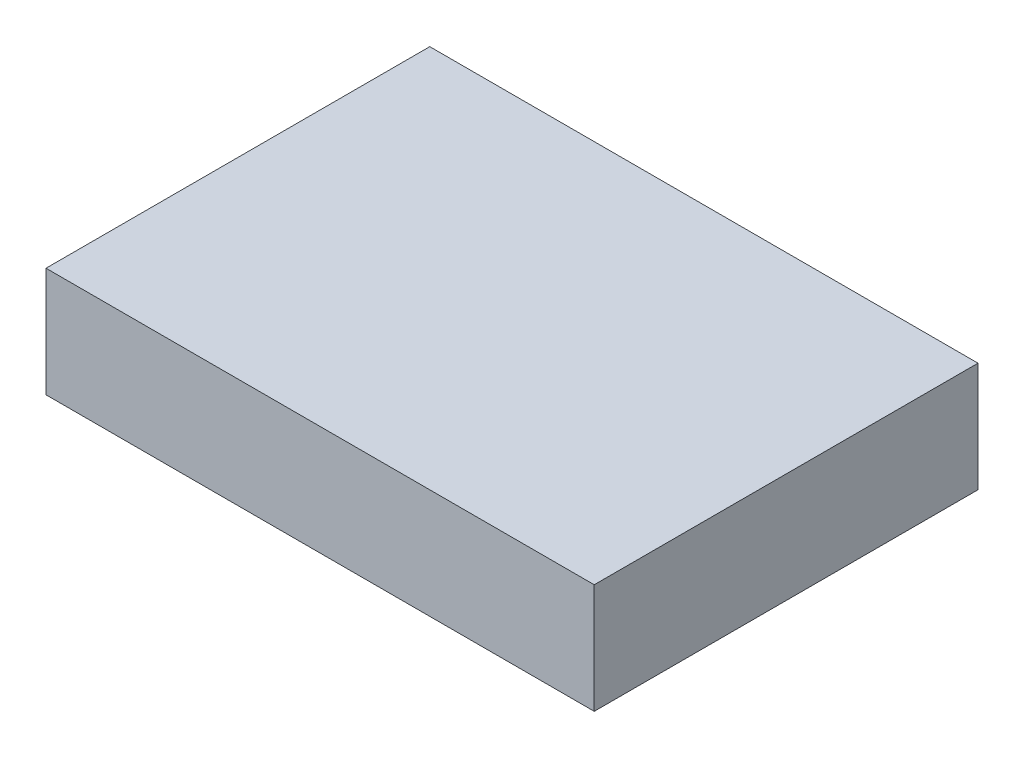
ISO-10303-21;
HEADER;
FILE_DESCRIPTION(('STEP AP214'),'2;1');
FILE_NAME('part.step','',(''),(''),'','','');
FILE_SCHEMA(('AUTOMOTIVE_DESIGN { 1 0 10303 214 1 1 1 1 }'));
ENDSEC;
DATA;
#1=APPLICATION_CONTEXT('core data for automotive mechanical design processes');
#2=APPLICATION_PROTOCOL_DEFINITION('international standard','automotive_design',2000,#1);
#3=PRODUCT_CONTEXT('',#1,'mechanical');
#4=PRODUCT('Part','Part','',(#3));
#5=PRODUCT_RELATED_PRODUCT_CATEGORY('part','',(#4));
#6=PRODUCT_DEFINITION_FORMATION('','',#4);
#7=PRODUCT_DEFINITION_CONTEXT('part definition',#1,'design');
#8=PRODUCT_DEFINITION('design','',#6,#7);
#9=PRODUCT_DEFINITION_SHAPE('','',#8);
#10=(LENGTH_UNIT() NAMED_UNIT(*) SI_UNIT(.MILLI.,.METRE.));
#11=(NAMED_UNIT(*) PLANE_ANGLE_UNIT() SI_UNIT($,.RADIAN.));
#12=(NAMED_UNIT(*) SI_UNIT($,.STERADIAN.) SOLID_ANGLE_UNIT());
#13=UNCERTAINTY_MEASURE_WITH_UNIT(LENGTH_MEASURE(1.E-05),#10,'distance_accuracy_value','');
#14=(GEOMETRIC_REPRESENTATION_CONTEXT(3) GLOBAL_UNCERTAINTY_ASSIGNED_CONTEXT((#13)) GLOBAL_UNIT_ASSIGNED_CONTEXT((#10,
#11,#12)) REPRESENTATION_CONTEXT('',''));
#15=CARTESIAN_POINT('',(0.,0.,0.));
#16=DIRECTION('',(0.,0.,1.));
#17=DIRECTION('',(1.,0.,0.));
#18=AXIS2_PLACEMENT_3D('',#15,#16,#17);
#19=CARTESIAN_POINT('',(-30.7894736842105,10.,-9.29824561403509));
#20=DIRECTION('',(1.,0.,0.));
#21=DIRECTION('',(0.,0.,-1.));
#22=AXIS2_PLACEMENT_3D('',#19,#20,#21);
#23=PLANE('',#22);
#24=DIRECTION('',(0.,0.,1.));
#25=VECTOR('',#24,1.);
#26=CARTESIAN_POINT('',(-30.7894736842105,0.,-9.29824561403509));
#27=LINE('',#26,#25);
#28=CARTESIAN_POINT('',(-30.7894736842105,0.,-9.29824561403509));
#29=VERTEX_POINT('',#28);
#30=CARTESIAN_POINT('',(-30.7894736842105,0.,25.7017543859649));
#31=VERTEX_POINT('',#30);
#32=EDGE_CURVE('E96',#29,#31,#27,.T.);
#33=ORIENTED_EDGE('',*,*,#32,.T.);
#34=DIRECTION('',(0.,-1.,0.));
#35=VECTOR('',#34,1.);
#36=CARTESIAN_POINT('',(-30.7894736842105,10.,25.7017543859649));
#37=LINE('',#36,#35);
#38=CARTESIAN_POINT('',(-30.7894736842105,10.,25.7017543859649));
#39=VERTEX_POINT('',#38);
#40=EDGE_CURVE('E11',#39,#31,#37,.T.);
#41=ORIENTED_EDGE('',*,*,#40,.F.);
#42=DIRECTION('',(0.,0.,1.));
#43=VECTOR('',#42,1.);
#44=CARTESIAN_POINT('',(-30.7894736842105,10.,-9.29824561403509));
#45=LINE('',#44,#43);
#46=CARTESIAN_POINT('',(-30.7894736842105,10.,-9.29824561403509));
#47=VERTEX_POINT('',#46);
#48=EDGE_CURVE('E84',#47,#39,#45,.T.);
#49=ORIENTED_EDGE('',*,*,#48,.F.);
#50=DIRECTION('',(0.,-1.,0.));
#51=VECTOR('',#50,1.);
#52=CARTESIAN_POINT('',(-30.7894736842105,10.,-9.29824561403509));
#53=LINE('',#52,#51);
#54=EDGE_CURVE('E92',#47,#29,#53,.T.);
#55=ORIENTED_EDGE('',*,*,#54,.T.);
#56=EDGE_LOOP('',(#33,#41,#49,#55));
#57=FACE_BOUND('',#56,.T.);
#58=ADVANCED_FACE('F33',(#57),#23,.F.);
#59=CARTESIAN_POINT('',(-30.7894736842105,10.,25.7017543859649));
#60=DIRECTION('',(0.,0.,-1.));
#61=DIRECTION('',(-1.,0.,0.));
#62=AXIS2_PLACEMENT_3D('',#59,#60,#61);
#63=PLANE('',#62);
#64=DIRECTION('',(1.,0.,0.));
#65=VECTOR('',#64,1.);
#66=CARTESIAN_POINT('',(-30.7894736842105,0.,25.7017543859649));
#67=LINE('',#66,#65);
#68=CARTESIAN_POINT('',(19.2105263157895,0.,25.7017543859649));
#69=VERTEX_POINT('',#68);
#70=EDGE_CURVE('E88',#31,#69,#67,.T.);
#71=ORIENTED_EDGE('',*,*,#70,.T.);
#72=DIRECTION('',(0.,-1.,0.));
#73=VECTOR('',#72,1.);
#74=CARTESIAN_POINT('',(19.2105263157895,10.,25.7017543859649));
#75=LINE('',#74,#73);
#76=CARTESIAN_POINT('',(19.2105263157895,10.,25.7017543859649));
#77=VERTEX_POINT('',#76);
#78=EDGE_CURVE('E41',#77,#69,#75,.T.);
#79=ORIENTED_EDGE('',*,*,#78,.F.);
#80=DIRECTION('',(1.,0.,0.));
#81=VECTOR('',#80,1.);
#82=CARTESIAN_POINT('',(-30.7894736842105,10.,25.7017543859649));
#83=LINE('',#82,#81);
#84=EDGE_CURVE('E79',#39,#77,#83,.T.);
#85=ORIENTED_EDGE('',*,*,#84,.F.);
#86=ORIENTED_EDGE('',*,*,#40,.T.);
#87=EDGE_LOOP('',(#71,#79,#85,#86));
#88=FACE_BOUND('',#87,.T.);
#89=ADVANCED_FACE('F87',(#88),#63,.F.);
#90=CARTESIAN_POINT('',(19.2105263157895,10.,-9.29824561403509));
#91=DIRECTION('',(-1.,0.,0.));
#92=DIRECTION('',(0.,0.,1.));
#93=AXIS2_PLACEMENT_3D('',#90,#91,#92);
#94=PLANE('',#93);
#95=DIRECTION('',(0.,0.,-1.));
#96=VECTOR('',#95,1.);
#97=CARTESIAN_POINT('',(19.2105263157895,0.,-9.29824561403509));
#98=LINE('',#97,#96);
#99=CARTESIAN_POINT('',(19.2105263157895,0.,-9.29824561403509));
#100=VERTEX_POINT('',#99);
#101=EDGE_CURVE('E66',#69,#100,#98,.T.);
#102=ORIENTED_EDGE('',*,*,#101,.T.);
#103=DIRECTION('',(0.,-1.,0.));
#104=VECTOR('',#103,1.);
#105=CARTESIAN_POINT('',(19.2105263157895,10.,-9.29824561403509));
#106=LINE('',#105,#104);
#107=CARTESIAN_POINT('',(19.2105263157895,10.,-9.29824561403509));
#108=VERTEX_POINT('',#107);
#109=EDGE_CURVE('E89',#108,#100,#106,.T.);
#110=ORIENTED_EDGE('',*,*,#109,.F.);
#111=DIRECTION('',(0.,0.,-1.));
#112=VECTOR('',#111,1.);
#113=CARTESIAN_POINT('',(19.2105263157895,10.,-9.29824561403509));
#114=LINE('',#113,#112);
#115=EDGE_CURVE('E82',#77,#108,#114,.T.);
#116=ORIENTED_EDGE('',*,*,#115,.F.);
#117=ORIENTED_EDGE('',*,*,#78,.T.);
#118=EDGE_LOOP('',(#102,#110,#116,#117));
#119=FACE_BOUND('',#118,.T.);
#120=ADVANCED_FACE('F90',(#119),#94,.F.);
#121=CARTESIAN_POINT('',(-30.7894736842105,10.,-9.29824561403509));
#122=DIRECTION('',(0.,0.,1.));
#123=DIRECTION('',(1.,0.,0.));
#124=AXIS2_PLACEMENT_3D('',#121,#122,#123);
#125=PLANE('',#124);
#126=DIRECTION('',(-1.,0.,0.));
#127=VECTOR('',#126,1.);
#128=CARTESIAN_POINT('',(-30.7894736842105,0.,-9.29824561403509));
#129=LINE('',#128,#127);
#130=EDGE_CURVE('E72',#100,#29,#129,.T.);
#131=ORIENTED_EDGE('',*,*,#130,.T.);
#132=ORIENTED_EDGE('',*,*,#54,.F.);
#133=DIRECTION('',(-1.,0.,0.));
#134=VECTOR('',#133,1.);
#135=CARTESIAN_POINT('',(-30.7894736842105,10.,-9.29824561403509));
#136=LINE('',#135,#134);
#137=EDGE_CURVE('E49',#108,#47,#136,.T.);
#138=ORIENTED_EDGE('',*,*,#137,.F.);
#139=ORIENTED_EDGE('',*,*,#109,.T.);
#140=EDGE_LOOP('',(#131,#132,#138,#139));
#141=FACE_BOUND('',#140,.T.);
#142=ADVANCED_FACE('F103',(#141),#125,.F.);
#143=CARTESIAN_POINT('',(0.,10.,0.));
#144=DIRECTION('',(0.,1.,0.));
#145=DIRECTION('',(0.,0.,1.));
#146=AXIS2_PLACEMENT_3D('',#143,#144,#145);
#147=PLANE('',#146);
#148=ORIENTED_EDGE('',*,*,#48,.T.);
#149=ORIENTED_EDGE('',*,*,#84,.T.);
#150=ORIENTED_EDGE('',*,*,#115,.T.);
#151=ORIENTED_EDGE('',*,*,#137,.T.);
#152=EDGE_LOOP('',(#148,#149,#150,#151));
#153=FACE_BOUND('',#152,.T.);
#154=ADVANCED_FACE('F80',(#153),#147,.T.);
#155=CARTESIAN_POINT('',(0.,0.,0.));
#156=DIRECTION('',(0.,1.,0.));
#157=DIRECTION('',(0.,0.,1.));
#158=AXIS2_PLACEMENT_3D('',#155,#156,#157);
#159=PLANE('',#158);
#160=ORIENTED_EDGE('',*,*,#32,.F.);
#161=ORIENTED_EDGE('',*,*,#130,.F.);
#162=ORIENTED_EDGE('',*,*,#101,.F.);
#163=ORIENTED_EDGE('',*,*,#70,.F.);
#164=EDGE_LOOP('',(#160,#161,#162,#163));
#165=FACE_BOUND('',#164,.T.);
#166=ADVANCED_FACE('F106',(#165),#159,.F.);
#167=CLOSED_SHELL('',(#58,#89,#120,#142,#154,#166));
#168=MANIFOLD_SOLID_BREP('B2',#167);
#169=ADVANCED_BREP_SHAPE_REPRESENTATION('',(#18,#168),#14);
#170=SHAPE_DEFINITION_REPRESENTATION(#9,#169);
ENDSEC;
END-ISO-10303-21;
